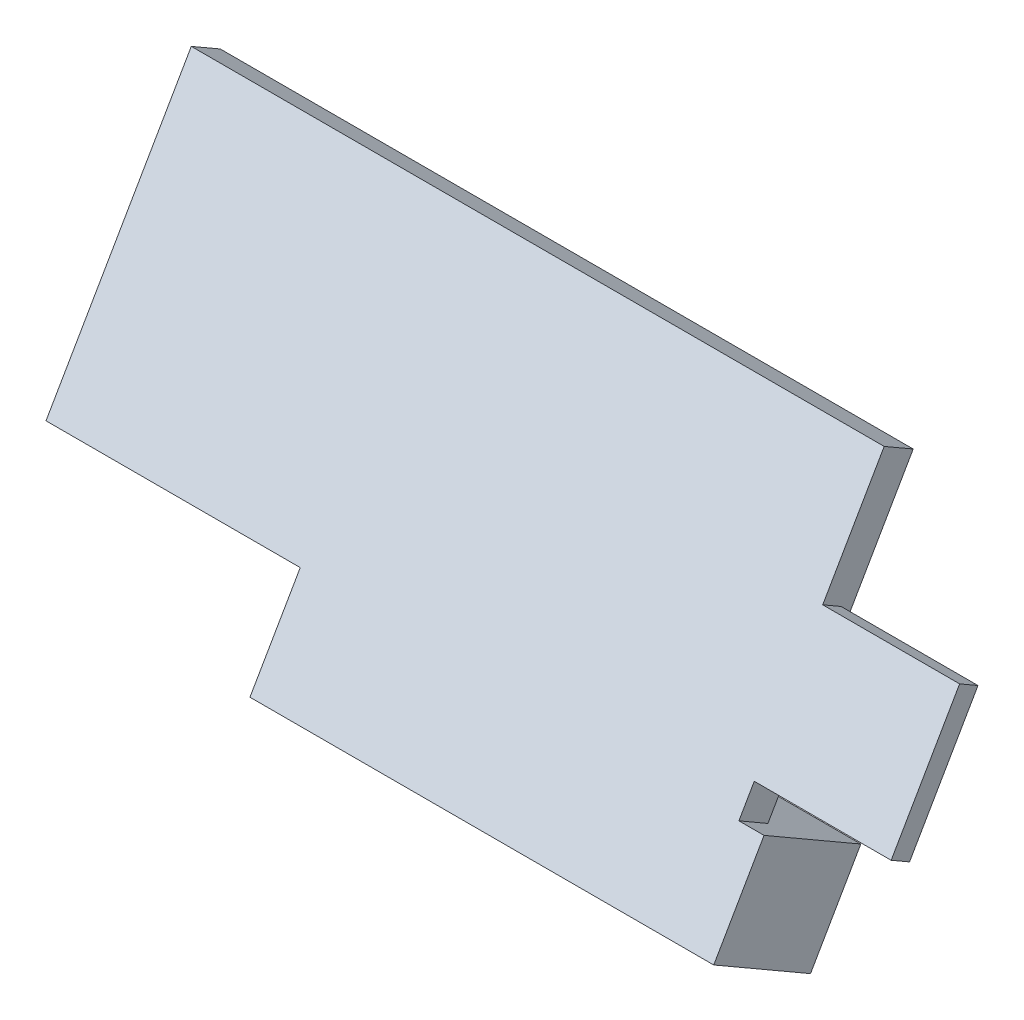
ISO-10303-21;
HEADER;
FILE_DESCRIPTION(('STEP AP214'),'2;1');
FILE_NAME('part.step','',(''),(''),'','','');
FILE_SCHEMA(('AUTOMOTIVE_DESIGN { 1 0 10303 214 1 1 1 1 }'));
ENDSEC;
DATA;
#1=APPLICATION_CONTEXT('core data for automotive mechanical design processes');
#2=APPLICATION_PROTOCOL_DEFINITION('international standard','automotive_design',2000,#1);
#3=PRODUCT_CONTEXT('',#1,'mechanical');
#4=PRODUCT('Part','Part','',(#3));
#5=PRODUCT_RELATED_PRODUCT_CATEGORY('part','',(#4));
#6=PRODUCT_DEFINITION_FORMATION('','',#4);
#7=PRODUCT_DEFINITION_CONTEXT('part definition',#1,'design');
#8=PRODUCT_DEFINITION('design','',#6,#7);
#9=PRODUCT_DEFINITION_SHAPE('','',#8);
#10=(LENGTH_UNIT() NAMED_UNIT(*) SI_UNIT(.MILLI.,.METRE.));
#11=(NAMED_UNIT(*) PLANE_ANGLE_UNIT() SI_UNIT($,.RADIAN.));
#12=(NAMED_UNIT(*) SI_UNIT($,.STERADIAN.) SOLID_ANGLE_UNIT());
#13=UNCERTAINTY_MEASURE_WITH_UNIT(LENGTH_MEASURE(1.E-05),#10,'distance_accuracy_value','');
#14=(GEOMETRIC_REPRESENTATION_CONTEXT(3) GLOBAL_UNCERTAINTY_ASSIGNED_CONTEXT((#13)) GLOBAL_UNIT_ASSIGNED_CONTEXT((#10,
#11,#12)) REPRESENTATION_CONTEXT('',''));
#15=CARTESIAN_POINT('',(0.,0.,0.));
#16=DIRECTION('',(0.,0.,1.));
#17=DIRECTION('',(1.,0.,0.));
#18=AXIS2_PLACEMENT_3D('',#15,#16,#17);
#19=CARTESIAN_POINT('',(92.625,31.6741244318082,8.27660161513775));
#20=DIRECTION('',(0.,-0.5,-0.866025403784439));
#21=DIRECTION('',(0.,0.866025403784439,-0.5));
#22=AXIS2_PLACEMENT_3D('',#19,#20,#21);
#23=PLANE('',#22);
#24=DIRECTION('',(1.,0.,0.));
#25=VECTOR('',#24,1.);
#26=CARTESIAN_POINT('',(86.5,36.9785300299879,5.21410161513775));
#27=LINE('',#26,#25);
#28=CARTESIAN_POINT('',(98.75,36.9785300299879,5.21410161513775));
#29=VERTEX_POINT('',#28);
#30=CARTESIAN_POINT('',(86.5,36.9785300299879,5.21410161513775));
#31=VERTEX_POINT('',#30);
#32=EDGE_CURVE('E133',#29,#31,#27,.F.);
#33=ORIENTED_EDGE('',*,*,#32,.F.);
#34=DIRECTION('',(0.,0.866025403784437,-0.500000000000002));
#35=VECTOR('',#34,1.);
#36=CARTESIAN_POINT('',(98.75,26.3697188336285,11.3391016151378));
#37=LINE('',#36,#35);
#38=CARTESIAN_POINT('',(98.75,26.3697188336285,11.3391016151378));
#39=VERTEX_POINT('',#38);
#40=EDGE_CURVE('E124',#39,#29,#37,.T.);
#41=ORIENTED_EDGE('',*,*,#40,.F.);
#42=DIRECTION('',(1.,0.,0.));
#43=VECTOR('',#42,1.);
#44=CARTESIAN_POINT('',(98.75,26.3697188336285,11.3391016151378));
#45=LINE('',#44,#43);
#46=CARTESIAN_POINT('',(86.5,26.3697188336285,11.3391016151378));
#47=VERTEX_POINT('',#46);
#48=EDGE_CURVE('E119',#47,#39,#45,.T.);
#49=ORIENTED_EDGE('',*,*,#48,.F.);
#50=DIRECTION('',(0.,-0.866025403784437,0.500000000000002));
#51=VECTOR('',#50,1.);
#52=CARTESIAN_POINT('',(86.5,36.9785300299879,5.21410161513775));
#53=LINE('',#52,#51);
#54=EDGE_CURVE('E137',#31,#47,#53,.T.);
#55=ORIENTED_EDGE('',*,*,#54,.F.);
#56=EDGE_LOOP('',(#33,#41,#49,#55));
#57=FACE_BOUND('',#56,.T.);
#58=ADVANCED_FACE('F17',(#57),#23,.T.);
#59=CARTESIAN_POINT('',(68.,16.0410346561913,7.9492958444838));
#60=DIRECTION('',(0.,-0.5,-0.866025403784439));
#61=DIRECTION('',(0.,0.866025403784439,-0.5));
#62=AXIS2_PLACEMENT_3D('',#59,#60,#61);
#63=PLANE('',#62);
#64=DIRECTION('',(1.,0.,0.));
#65=VECTOR('',#64,1.);
#66=CARTESIAN_POINT('',(47.25,19.9381489732213,5.6992958444838));
#67=LINE('',#66,#65);
#68=CARTESIAN_POINT('',(88.75,19.9381489732213,5.6992958444838));
#69=VERTEX_POINT('',#68);
#70=CARTESIAN_POINT('',(47.25,19.9381489732213,5.6992958444838));
#71=VERTEX_POINT('',#70);
#72=EDGE_CURVE('E165',#69,#71,#67,.F.);
#73=ORIENTED_EDGE('',*,*,#72,.F.);
#74=DIRECTION('',(0.,0.866025403784437,-0.500000000000002));
#75=VECTOR('',#74,1.);
#76=CARTESIAN_POINT('',(88.75,12.1439203391614,10.1992958444838));
#77=LINE('',#76,#75);
#78=CARTESIAN_POINT('',(88.75,12.1439203391614,10.1992958444838));
#79=VERTEX_POINT('',#78);
#80=EDGE_CURVE('E172',#79,#69,#77,.T.);
#81=ORIENTED_EDGE('',*,*,#80,.F.);
#82=DIRECTION('',(1.,0.,0.));
#83=VECTOR('',#82,1.);
#84=CARTESIAN_POINT('',(88.75,12.1439203391614,10.1992958444838));
#85=LINE('',#84,#83);
#86=CARTESIAN_POINT('',(47.25,12.1439203391614,10.1992958444838));
#87=VERTEX_POINT('',#86);
#88=EDGE_CURVE('E177',#87,#79,#85,.T.);
#89=ORIENTED_EDGE('',*,*,#88,.F.);
#90=DIRECTION('',(0.,-0.866025403784437,0.500000000000002));
#91=VECTOR('',#90,1.);
#92=CARTESIAN_POINT('',(47.25,19.9381489732213,5.6992958444838));
#93=LINE('',#92,#91);
#94=EDGE_CURVE('E186',#71,#87,#93,.T.);
#95=ORIENTED_EDGE('',*,*,#94,.F.);
#96=EDGE_LOOP('',(#73,#81,#89,#95));
#97=FACE_BOUND('',#96,.T.);
#98=ADVANCED_FACE('F316',(#97),#63,.T.);
#99=CARTESIAN_POINT('',(55.5,34.696479222419,5.26147367097487));
#100=DIRECTION('',(0.,-0.5,-0.866025403784439));
#101=DIRECTION('',(0.,0.866025403784439,-0.5));
#102=AXIS2_PLACEMENT_3D('',#99,#100,#101);
#103=PLANE('',#102);
#104=DIRECTION('',(1.,0.,0.));
#105=VECTOR('',#104,1.);
#106=CARTESIAN_POINT('',(24.5,45.9548094716167,-1.23852632902512));
#107=LINE('',#106,#105);
#108=CARTESIAN_POINT('',(86.5,45.9548094716167,-1.23852632902512));
#109=VERTEX_POINT('',#108);
#110=CARTESIAN_POINT('',(24.5,45.9548094716167,-1.23852632902512));
#111=VERTEX_POINT('',#110);
#112=EDGE_CURVE('E20',#109,#111,#107,.F.);
#113=ORIENTED_EDGE('',*,*,#112,.F.);
#114=DIRECTION('',(0.,0.866025403784438,-0.500000000000001));
#115=VECTOR('',#114,1.);
#116=CARTESIAN_POINT('',(86.5,23.4381489732213,11.7614736709749));
#117=LINE('',#116,#115);
#118=CARTESIAN_POINT('',(86.5,23.4381489732213,11.7614736709749));
#119=VERTEX_POINT('',#118);
#120=EDGE_CURVE('E153',#119,#109,#117,.T.);
#121=ORIENTED_EDGE('',*,*,#120,.F.);
#122=DIRECTION('',(1.,0.,0.));
#123=VECTOR('',#122,1.);
#124=CARTESIAN_POINT('',(47.25,23.4381489732213,11.7614736709749));
#125=LINE('',#124,#123);
#126=CARTESIAN_POINT('',(47.25,23.4381489732213,11.7614736709749));
#127=VERTEX_POINT('',#126);
#128=EDGE_CURVE('E168',#127,#119,#125,.T.);
#129=ORIENTED_EDGE('',*,*,#128,.F.);
#130=DIRECTION('',(1.,0.,0.));
#131=VECTOR('',#130,1.);
#132=CARTESIAN_POINT('',(86.5,23.4381489732213,11.7614736709749));
#133=LINE('',#132,#131);
#134=CARTESIAN_POINT('',(24.5,23.4381489732213,11.7614736709749));
#135=VERTEX_POINT('',#134);
#136=EDGE_CURVE('E195',#135,#127,#133,.T.);
#137=ORIENTED_EDGE('',*,*,#136,.F.);
#138=DIRECTION('',(0.,-0.866025403784438,0.500000000000001));
#139=VECTOR('',#138,1.);
#140=CARTESIAN_POINT('',(24.5,45.9548094716167,-1.23852632902512));
#141=LINE('',#140,#139);
#142=EDGE_CURVE('E202',#111,#135,#141,.T.);
#143=ORIENTED_EDGE('',*,*,#142,.F.);
#144=EDGE_LOOP('',(#113,#121,#129,#137,#143));
#145=FACE_BOUND('',#144,.T.);
#146=ADVANCED_FACE('F314',(#145),#103,.T.);
#147=CARTESIAN_POINT('',(24.5,47.4548094716167,1.35954988232819));
#148=DIRECTION('',(0.,0.866025403784439,-0.5));
#149=DIRECTION('',(0.,0.5,0.866025403784439));
#150=AXIS2_PLACEMENT_3D('',#147,#148,#149);
#151=PLANE('',#150);
#152=ORIENTED_EDGE('',*,*,#112,.T.);
#153=DIRECTION('',(0.,-0.500000000000001,-0.866025403784438));
#154=VECTOR('',#153,1.);
#155=CARTESIAN_POINT('',(24.5,47.4548094716167,1.35954988232819));
#156=LINE('',#155,#154);
#157=CARTESIAN_POINT('',(24.5,47.4548094716167,1.3595498823282));
#158=VERTEX_POINT('',#157);
#159=EDGE_CURVE('E199',#158,#111,#156,.T.);
#160=ORIENTED_EDGE('',*,*,#159,.F.);
#161=DIRECTION('',(1.,0.,0.));
#162=VECTOR('',#161,1.);
#163=CARTESIAN_POINT('',(52.8749999999999,47.4548094716167,1.35954988232823));
#164=LINE('',#163,#162);
#165=CARTESIAN_POINT('',(86.5,47.4548094716167,1.3595498823282));
#166=VERTEX_POINT('',#165);
#167=EDGE_CURVE('E207',#158,#166,#164,.T.);
#168=ORIENTED_EDGE('',*,*,#167,.T.);
#169=DIRECTION('',(0.,0.500000000000001,0.866025403784438));
#170=VECTOR('',#169,1.);
#171=CARTESIAN_POINT('',(86.5,45.9548094716167,-1.23852632902512));
#172=LINE('',#171,#170);
#173=EDGE_CURVE('E155',#109,#166,#172,.T.);
#174=ORIENTED_EDGE('',*,*,#173,.F.);
#175=EDGE_LOOP('',(#152,#160,#168,#174));
#176=FACE_BOUND('',#175,.T.);
#177=ADVANCED_FACE('F281',(#176),#151,.T.);
#178=CARTESIAN_POINT('',(86.5,38.7285300299879,8.24519052838329));
#179=DIRECTION('',(0.,0.866025403784439,-0.5));
#180=DIRECTION('',(0.,0.5,0.866025403784439));
#181=AXIS2_PLACEMENT_3D('',#178,#179,#180);
#182=PLANE('',#181);
#183=ORIENTED_EDGE('',*,*,#32,.T.);
#184=DIRECTION('',(0.,-0.499999999999995,-0.866025403784441));
#185=VECTOR('',#184,1.);
#186=CARTESIAN_POINT('',(86.5,37.9285300299879,6.85954988232819));
#187=LINE('',#186,#185);
#188=CARTESIAN_POINT('',(86.5,37.9285300299879,6.8595498823282));
#189=VERTEX_POINT('',#188);
#190=EDGE_CURVE('E157',#189,#31,#187,.T.);
#191=ORIENTED_EDGE('',*,*,#190,.F.);
#192=DIRECTION('',(1.,0.,0.));
#193=VECTOR('',#192,1.);
#194=CARTESIAN_POINT('',(52.8749999999999,37.9285300299879,6.85954988232822));
#195=LINE('',#194,#193);
#196=CARTESIAN_POINT('',(98.75,37.9285300299879,6.8595498823282));
#197=VERTEX_POINT('',#196);
#198=EDGE_CURVE('E144',#189,#197,#195,.T.);
#199=ORIENTED_EDGE('',*,*,#198,.T.);
#200=DIRECTION('',(0.,0.499999999999995,0.866025403784441));
#201=VECTOR('',#200,1.);
#202=CARTESIAN_POINT('',(98.75,36.9785300299879,5.21410161513775));
#203=LINE('',#202,#201);
#204=EDGE_CURVE('E129',#29,#197,#203,.T.);
#205=ORIENTED_EDGE('',*,*,#204,.F.);
#206=EDGE_LOOP('',(#183,#191,#199,#205));
#207=FACE_BOUND('',#206,.T.);
#208=ADVANCED_FACE('F142',(#207),#182,.T.);
#209=CARTESIAN_POINT('',(98.75,38.7285300299879,8.24519052838329));
#210=DIRECTION('',(1.,0.,0.));
#211=DIRECTION('',(0.,0.,-1.));
#212=AXIS2_PLACEMENT_3D('',#209,#210,#211);
#213=PLANE('',#212);
#214=ORIENTED_EDGE('',*,*,#40,.T.);
#215=ORIENTED_EDGE('',*,*,#204,.T.);
#216=DIRECTION('',(0.,0.866025403784439,-0.5));
#217=VECTOR('',#216,1.);
#218=CARTESIAN_POINT('',(98.75,30.3179152817722,11.2535403559091));
#219=LINE('',#218,#217);
#220=CARTESIAN_POINT('',(98.75,27.3197188336285,12.9845498823282));
#221=VERTEX_POINT('',#220);
#222=EDGE_CURVE('E216',#197,#221,#219,.F.);
#223=ORIENTED_EDGE('',*,*,#222,.T.);
#224=DIRECTION('',(0.,-0.5,-0.866025403784439));
#225=VECTOR('',#224,1.);
#226=CARTESIAN_POINT('',(98.75,28.1197188336285,14.3701905283833));
#227=LINE('',#226,#225);
#228=EDGE_CURVE('E131',#39,#221,#227,.F.);
#229=ORIENTED_EDGE('',*,*,#228,.F.);
#230=EDGE_LOOP('',(#214,#215,#223,#229));
#231=FACE_BOUND('',#230,.T.);
#232=ADVANCED_FACE('F126',(#231),#213,.T.);
#233=CARTESIAN_POINT('',(98.75,28.1197188336285,14.3701905283833));
#234=DIRECTION('',(0.,-0.866025403784439,0.5));
#235=DIRECTION('',(0.,-0.5,-0.866025403784439));
#236=AXIS2_PLACEMENT_3D('',#233,#234,#235);
#237=PLANE('',#236);
#238=ORIENTED_EDGE('',*,*,#48,.T.);
#239=ORIENTED_EDGE('',*,*,#228,.T.);
#240=DIRECTION('',(1.,0.,0.));
#241=VECTOR('',#240,1.);
#242=CARTESIAN_POINT('',(52.8749999999999,27.3197188336285,12.9845498823282));
#243=LINE('',#242,#241);
#244=CARTESIAN_POINT('',(86.5,27.3197188336285,12.9845498823282));
#245=VERTEX_POINT('',#244);
#246=EDGE_CURVE('E218',#221,#245,#243,.F.);
#247=ORIENTED_EDGE('',*,*,#246,.T.);
#248=DIRECTION('',(0.,0.500000000000007,0.866025403784434));
#249=VECTOR('',#248,1.);
#250=CARTESIAN_POINT('',(86.5,26.3697188336285,11.3391016151378));
#251=LINE('',#250,#249);
#252=EDGE_CURVE('E150',#47,#245,#251,.T.);
#253=ORIENTED_EDGE('',*,*,#252,.F.);
#254=EDGE_LOOP('',(#238,#239,#247,#253));
#255=FACE_BOUND('',#254,.T.);
#256=ADVANCED_FACE('F276',(#255),#237,.T.);
#257=CARTESIAN_POINT('',(86.5,47.4548094716167,1.35954988232819));
#258=DIRECTION('',(1.,0.,0.));
#259=DIRECTION('',(0.,0.,-1.));
#260=AXIS2_PLACEMENT_3D('',#257,#258,#259);
#261=PLANE('',#260);
#262=ORIENTED_EDGE('',*,*,#190,.T.);
#263=ORIENTED_EDGE('',*,*,#54,.T.);
#264=ORIENTED_EDGE('',*,*,#252,.T.);
#265=DIRECTION('',(0.,0.866025403784439,-0.5));
#266=VECTOR('',#265,1.);
#267=CARTESIAN_POINT('',(86.5,30.3179152817722,11.2535403559091));
#268=LINE('',#267,#266);
#269=CARTESIAN_POINT('',(86.5,24.9381489732213,14.3595498823282));
#270=VERTEX_POINT('',#269);
#271=EDGE_CURVE('E222',#245,#270,#268,.F.);
#272=ORIENTED_EDGE('',*,*,#271,.T.);
#273=DIRECTION('',(0.,0.5,0.866025403784439));
#274=VECTOR('',#273,1.);
#275=CARTESIAN_POINT('',(86.5,24.9381489732213,14.3595498823282));
#276=LINE('',#275,#274);
#277=EDGE_CURVE('E162',#119,#270,#276,.T.);
#278=ORIENTED_EDGE('',*,*,#277,.F.);
#279=ORIENTED_EDGE('',*,*,#120,.T.);
#280=ORIENTED_EDGE('',*,*,#173,.T.);
#281=DIRECTION('',(0.,0.866025403784439,-0.5));
#282=VECTOR('',#281,1.);
#283=CARTESIAN_POINT('',(86.5,30.3179152817722,11.2535403559091));
#284=LINE('',#283,#282);
#285=EDGE_CURVE('E211',#166,#189,#284,.F.);
#286=ORIENTED_EDGE('',*,*,#285,.T.);
#287=EDGE_LOOP('',(#262,#263,#264,#272,#278,#279,#280,#286));
#288=FACE_BOUND('',#287,.T.);
#289=ADVANCED_FACE('F275',(#288),#261,.T.);
#290=CARTESIAN_POINT('',(47.25,24.9381489732213,14.3595498823282));
#291=DIRECTION('',(0.,0.866025403784439,-0.5));
#292=DIRECTION('',(0.,0.5,0.866025403784439));
#293=AXIS2_PLACEMENT_3D('',#290,#291,#292);
#294=PLANE('',#293);
#295=DIRECTION('',(0.,-0.499999999999999,-0.86602540378444));
#296=VECTOR('',#295,1.);
#297=CARTESIAN_POINT('',(47.25,23.4381489732213,11.7614736709749));
#298=LINE('',#297,#296);
#299=EDGE_CURVE('E182',#127,#71,#298,.T.);
#300=ORIENTED_EDGE('',*,*,#299,.F.);
#301=ORIENTED_EDGE('',*,*,#128,.T.);
#302=ORIENTED_EDGE('',*,*,#277,.T.);
#303=DIRECTION('',(1.,0.,0.));
#304=VECTOR('',#303,1.);
#305=CARTESIAN_POINT('',(52.8749999999999,24.9381489732213,14.3595498823282));
#306=LINE('',#305,#304);
#307=CARTESIAN_POINT('',(88.75,24.9381489732213,14.3595498823282));
#308=VERTEX_POINT('',#307);
#309=EDGE_CURVE('E226',#270,#308,#306,.T.);
#310=ORIENTED_EDGE('',*,*,#309,.T.);
#311=DIRECTION('',(0.,0.5,0.866025403784439));
#312=VECTOR('',#311,1.);
#313=CARTESIAN_POINT('',(88.75,19.9381489732213,5.6992958444838));
#314=LINE('',#313,#312);
#315=EDGE_CURVE('E174',#69,#308,#314,.T.);
#316=ORIENTED_EDGE('',*,*,#315,.F.);
#317=ORIENTED_EDGE('',*,*,#72,.T.);
#318=EDGE_LOOP('',(#300,#301,#302,#310,#316,#317));
#319=FACE_BOUND('',#318,.T.);
#320=ADVANCED_FACE('F270',(#319),#294,.T.);
#321=CARTESIAN_POINT('',(88.75,24.9381489732213,14.3595498823282));
#322=DIRECTION('',(1.,0.,0.));
#323=DIRECTION('',(0.,0.,-1.));
#324=AXIS2_PLACEMENT_3D('',#321,#322,#323);
#325=PLANE('',#324);
#326=ORIENTED_EDGE('',*,*,#80,.T.);
#327=ORIENTED_EDGE('',*,*,#315,.T.);
#328=DIRECTION('',(0.,0.866025403784439,-0.5));
#329=VECTOR('',#328,1.);
#330=CARTESIAN_POINT('',(88.75,30.3179152817722,11.2535403559091));
#331=LINE('',#330,#329);
#332=CARTESIAN_POINT('',(88.75,17.1439203391614,18.8595498823282));
#333=VERTEX_POINT('',#332);
#334=EDGE_CURVE('E230',#308,#333,#331,.F.);
#335=ORIENTED_EDGE('',*,*,#334,.T.);
#336=DIRECTION('',(0.,-0.5,-0.866025403784439));
#337=VECTOR('',#336,1.);
#338=CARTESIAN_POINT('',(88.75,17.1439203391614,18.8595498823282));
#339=LINE('',#338,#337);
#340=EDGE_CURVE('E180',#79,#333,#339,.F.);
#341=ORIENTED_EDGE('',*,*,#340,.F.);
#342=EDGE_LOOP('',(#326,#327,#335,#341));
#343=FACE_BOUND('',#342,.T.);
#344=ADVANCED_FACE('F265',(#343),#325,.T.);
#345=CARTESIAN_POINT('',(88.75,17.1439203391614,18.8595498823282));
#346=DIRECTION('',(0.,-0.866025403784439,0.5));
#347=DIRECTION('',(0.,-0.5,-0.866025403784439));
#348=AXIS2_PLACEMENT_3D('',#345,#346,#347);
#349=PLANE('',#348);
#350=ORIENTED_EDGE('',*,*,#88,.T.);
#351=ORIENTED_EDGE('',*,*,#340,.T.);
#352=DIRECTION('',(1.,0.,0.));
#353=VECTOR('',#352,1.);
#354=CARTESIAN_POINT('',(52.8749999999999,17.1439203391614,18.8595498823282));
#355=LINE('',#354,#353);
#356=CARTESIAN_POINT('',(47.25,17.1439203391614,18.8595498823282));
#357=VERTEX_POINT('',#356);
#358=EDGE_CURVE('E234',#333,#357,#355,.F.);
#359=ORIENTED_EDGE('',*,*,#358,.T.);
#360=DIRECTION('',(0.,0.499999999999999,0.866025403784439));
#361=VECTOR('',#360,1.);
#362=CARTESIAN_POINT('',(47.25,12.1439203391614,10.1992958444838));
#363=LINE('',#362,#361);
#364=EDGE_CURVE('E189',#87,#357,#363,.T.);
#365=ORIENTED_EDGE('',*,*,#364,.F.);
#366=EDGE_LOOP('',(#350,#351,#359,#365));
#367=FACE_BOUND('',#366,.T.);
#368=ADVANCED_FACE('F259',(#367),#349,.T.);
#369=CARTESIAN_POINT('',(47.25,17.1439203391614,18.8595498823282));
#370=DIRECTION('',(-1.,0.,0.));
#371=DIRECTION('',(0.,0.,1.));
#372=AXIS2_PLACEMENT_3D('',#369,#370,#371);
#373=PLANE('',#372);
#374=ORIENTED_EDGE('',*,*,#94,.T.);
#375=ORIENTED_EDGE('',*,*,#364,.T.);
#376=DIRECTION('',(0.,0.866025403784439,-0.5));
#377=VECTOR('',#376,1.);
#378=CARTESIAN_POINT('',(47.25,30.3179152817722,11.2535403559091));
#379=LINE('',#378,#377);
#380=CARTESIAN_POINT('',(47.25,24.9381489732213,14.3595498823282));
#381=VERTEX_POINT('',#380);
#382=EDGE_CURVE('E238',#357,#381,#379,.T.);
#383=ORIENTED_EDGE('',*,*,#382,.T.);
#384=DIRECTION('',(0.,-0.5,-0.866025403784439));
#385=VECTOR('',#384,1.);
#386=CARTESIAN_POINT('',(47.25,24.9381489732213,14.3595498823282));
#387=LINE('',#386,#385);
#388=EDGE_CURVE('E192',#127,#381,#387,.F.);
#389=ORIENTED_EDGE('',*,*,#388,.F.);
#390=ORIENTED_EDGE('',*,*,#299,.T.);
#391=EDGE_LOOP('',(#374,#375,#383,#389,#390));
#392=FACE_BOUND('',#391,.T.);
#393=ADVANCED_FACE('F254',(#392),#373,.T.);
#394=CARTESIAN_POINT('',(86.5,24.9381489732213,14.3595498823282));
#395=DIRECTION('',(0.,-0.866025403784439,0.5));
#396=DIRECTION('',(0.,-0.5,-0.866025403784439));
#397=AXIS2_PLACEMENT_3D('',#394,#395,#396);
#398=PLANE('',#397);
#399=DIRECTION('',(0.,0.500000000000002,0.866025403784438));
#400=VECTOR('',#399,1.);
#401=CARTESIAN_POINT('',(24.5,23.4381489732213,11.7614736709749));
#402=LINE('',#401,#400);
#403=CARTESIAN_POINT('',(24.5,24.9381489732213,14.3595498823282));
#404=VERTEX_POINT('',#403);
#405=EDGE_CURVE('E39',#135,#404,#402,.T.);
#406=ORIENTED_EDGE('',*,*,#405,.F.);
#407=ORIENTED_EDGE('',*,*,#136,.T.);
#408=ORIENTED_EDGE('',*,*,#388,.T.);
#409=DIRECTION('',(1.,0.,0.));
#410=VECTOR('',#409,1.);
#411=CARTESIAN_POINT('',(52.8749999999999,24.9381489732213,14.3595498823282));
#412=LINE('',#411,#410);
#413=EDGE_CURVE('E27',#381,#404,#412,.F.);
#414=ORIENTED_EDGE('',*,*,#413,.T.);
#415=EDGE_LOOP('',(#406,#407,#408,#414));
#416=FACE_BOUND('',#415,.T.);
#417=ADVANCED_FACE('F247',(#416),#398,.T.);
#418=CARTESIAN_POINT('',(24.5,24.9381489732213,14.3595498823282));
#419=DIRECTION('',(-1.,0.,0.));
#420=DIRECTION('',(0.,0.,1.));
#421=AXIS2_PLACEMENT_3D('',#418,#419,#420);
#422=PLANE('',#421);
#423=ORIENTED_EDGE('',*,*,#142,.T.);
#424=ORIENTED_EDGE('',*,*,#405,.T.);
#425=DIRECTION('',(0.,0.866025403784439,-0.5));
#426=VECTOR('',#425,1.);
#427=CARTESIAN_POINT('',(24.5,30.3179152817722,11.2535403559091));
#428=LINE('',#427,#426);
#429=EDGE_CURVE('E11',#404,#158,#428,.T.);
#430=ORIENTED_EDGE('',*,*,#429,.T.);
#431=ORIENTED_EDGE('',*,*,#159,.T.);
#432=EDGE_LOOP('',(#423,#424,#430,#431));
#433=FACE_BOUND('',#432,.T.);
#434=ADVANCED_FACE('F284',(#433),#422,.T.);
#435=CARTESIAN_POINT('',(52.8749999999999,30.3179152817722,11.2535403559091));
#436=DIRECTION('',(0.,-0.5,-0.866025403784439));
#437=DIRECTION('',(0.,0.866025403784439,-0.5));
#438=AXIS2_PLACEMENT_3D('',#435,#436,#437);
#439=PLANE('',#438);
#440=ORIENTED_EDGE('',*,*,#413,.F.);
#441=ORIENTED_EDGE('',*,*,#382,.F.);
#442=ORIENTED_EDGE('',*,*,#358,.F.);
#443=ORIENTED_EDGE('',*,*,#334,.F.);
#444=ORIENTED_EDGE('',*,*,#309,.F.);
#445=ORIENTED_EDGE('',*,*,#271,.F.);
#446=ORIENTED_EDGE('',*,*,#246,.F.);
#447=ORIENTED_EDGE('',*,*,#222,.F.);
#448=ORIENTED_EDGE('',*,*,#198,.F.);
#449=ORIENTED_EDGE('',*,*,#285,.F.);
#450=ORIENTED_EDGE('',*,*,#167,.F.);
#451=ORIENTED_EDGE('',*,*,#429,.F.);
#452=EDGE_LOOP('',(#440,#441,#442,#443,#444,#445,#446,#447,#448,#449,#450,#451));
#453=FACE_BOUND('',#452,.T.);
#454=ADVANCED_FACE('F251',(#453),#439,.F.);
#455=CLOSED_SHELL('',(#58,#98,#146,#177,#208,#232,#256,#289,#320,#344,#368,#393,#417,#434,#454));
#456=MANIFOLD_SOLID_BREP('B1',#455);
#457=ADVANCED_BREP_SHAPE_REPRESENTATION('',(#18,#456),#14);
#458=SHAPE_DEFINITION_REPRESENTATION(#9,#457);
ENDSEC;
END-ISO-10303-21;
